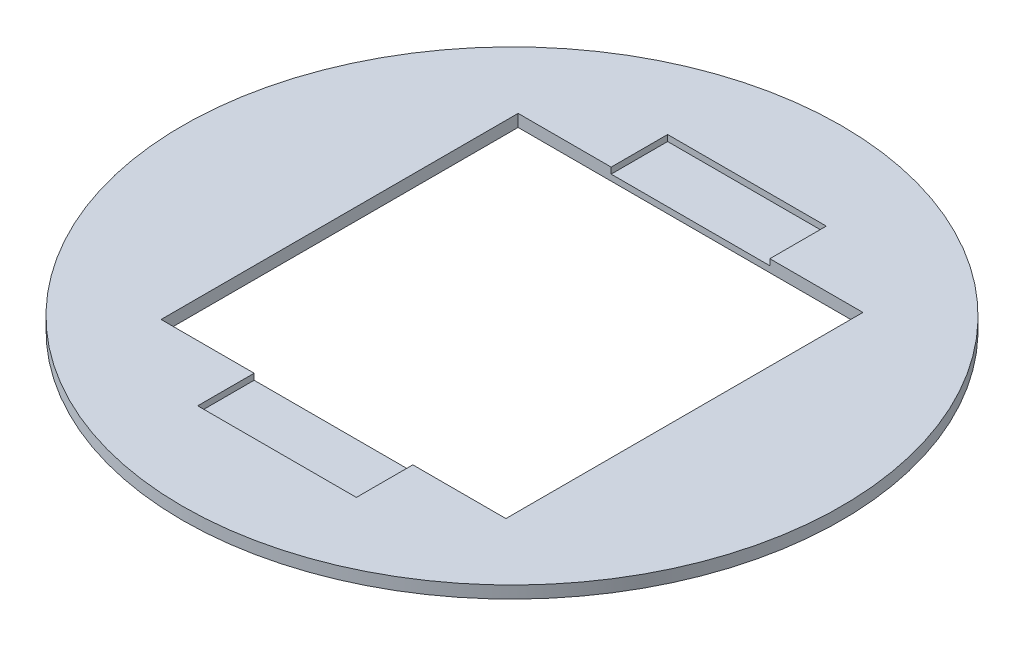
ISO-10303-21;
HEADER;
FILE_DESCRIPTION(('STEP AP214'),'2;1');
FILE_NAME('part.step','',(''),(''),'','','');
FILE_SCHEMA(('AUTOMOTIVE_DESIGN { 1 0 10303 214 1 1 1 1 }'));
ENDSEC;
DATA;
#1=APPLICATION_CONTEXT('core data for automotive mechanical design processes');
#2=APPLICATION_PROTOCOL_DEFINITION('international standard','automotive_design',2000,#1);
#3=PRODUCT_CONTEXT('',#1,'mechanical');
#4=PRODUCT('Part','Part','',(#3));
#5=PRODUCT_RELATED_PRODUCT_CATEGORY('part','',(#4));
#6=PRODUCT_DEFINITION_FORMATION('','',#4);
#7=PRODUCT_DEFINITION_CONTEXT('part definition',#1,'design');
#8=PRODUCT_DEFINITION('design','',#6,#7);
#9=PRODUCT_DEFINITION_SHAPE('','',#8);
#10=(LENGTH_UNIT() NAMED_UNIT(*) SI_UNIT(.MILLI.,.METRE.));
#11=(NAMED_UNIT(*) PLANE_ANGLE_UNIT() SI_UNIT($,.RADIAN.));
#12=(NAMED_UNIT(*) SI_UNIT($,.STERADIAN.) SOLID_ANGLE_UNIT());
#13=UNCERTAINTY_MEASURE_WITH_UNIT(LENGTH_MEASURE(1.E-05),#10,'distance_accuracy_value','');
#14=(GEOMETRIC_REPRESENTATION_CONTEXT(3) GLOBAL_UNCERTAINTY_ASSIGNED_CONTEXT((#13)) GLOBAL_UNIT_ASSIGNED_CONTEXT((#10,
#11,#12)) REPRESENTATION_CONTEXT('',''));
#15=CARTESIAN_POINT('',(0.,0.,0.));
#16=DIRECTION('',(0.,0.,1.));
#17=DIRECTION('',(1.,0.,0.));
#18=AXIS2_PLACEMENT_3D('',#15,#16,#17);
#19=CARTESIAN_POINT('',(0.,2.,0.));
#20=DIRECTION('',(0.,-1.,0.));
#21=DIRECTION('',(0.,0.,-1.));
#22=AXIS2_PLACEMENT_3D('',#19,#20,#21);
#23=CYLINDRICAL_SURFACE('',#22,54.);
#24=CARTESIAN_POINT('',(0.,2.,0.));
#25=DIRECTION('',(0.,1.,0.));
#26=DIRECTION('',(0.,0.,1.));
#27=AXIS2_PLACEMENT_3D('',#24,#25,#26);
#28=CIRCLE('',#27,54.);
#29=CARTESIAN_POINT('',(0.,2.,54.));
#30=VERTEX_POINT('',#29);
#31=EDGE_CURVE('E11',#30,#30,#28,.T.);
#32=ORIENTED_EDGE('',*,*,#31,.F.);
#33=EDGE_LOOP('',(#32));
#34=FACE_BOUND('',#33,.T.);
#35=CARTESIAN_POINT('',(0.,0.,0.));
#36=DIRECTION('',(0.,1.,0.));
#37=DIRECTION('',(0.,0.,1.));
#38=AXIS2_PLACEMENT_3D('',#35,#36,#37);
#39=CIRCLE('',#38,54.);
#40=CARTESIAN_POINT('',(0.,0.,54.));
#41=VERTEX_POINT('',#40);
#42=EDGE_CURVE('E36',#41,#41,#39,.T.);
#43=ORIENTED_EDGE('',*,*,#42,.T.);
#44=EDGE_LOOP('',(#43));
#45=FACE_BOUND('',#44,.T.);
#46=ADVANCED_FACE('F33',(#34,#45),#23,.T.);
#47=CARTESIAN_POINT('',(0.,2.,0.));
#48=DIRECTION('',(0.,1.,0.));
#49=DIRECTION('',(0.,0.,1.));
#50=AXIS2_PLACEMENT_3D('',#47,#48,#49);
#51=PLANE('',#50);
#52=DIRECTION('',(0.,0.,1.));
#53=VECTOR('',#52,1.);
#54=CARTESIAN_POINT('',(-13.,2.,38.5));
#55=LINE('',#54,#53);
#56=CARTESIAN_POINT('',(-13.,2.,29.25));
#57=VERTEX_POINT('',#56);
#58=CARTESIAN_POINT('',(-13.,2.,38.5));
#59=VERTEX_POINT('',#58);
#60=EDGE_CURVE('E142',#57,#59,#55,.T.);
#61=ORIENTED_EDGE('',*,*,#60,.F.);
#62=DIRECTION('',(1.,0.,0.));
#63=VECTOR('',#62,1.);
#64=CARTESIAN_POINT('',(28.25,2.,29.25));
#65=LINE('',#64,#63);
#66=CARTESIAN_POINT('',(-28.25,2.,29.25));
#67=VERTEX_POINT('',#66);
#68=EDGE_CURVE('E194',#67,#57,#65,.T.);
#69=ORIENTED_EDGE('',*,*,#68,.F.);
#70=DIRECTION('',(0.,0.,1.));
#71=VECTOR('',#70,1.);
#72=CARTESIAN_POINT('',(-28.25,2.,29.25));
#73=LINE('',#72,#71);
#74=CARTESIAN_POINT('',(-28.25,2.,-29.25));
#75=VERTEX_POINT('',#74);
#76=EDGE_CURVE('E176',#75,#67,#73,.T.);
#77=ORIENTED_EDGE('',*,*,#76,.F.);
#78=DIRECTION('',(-1.,0.,0.));
#79=VECTOR('',#78,1.);
#80=CARTESIAN_POINT('',(28.25,2.,-29.25));
#81=LINE('',#80,#79);
#82=CARTESIAN_POINT('',(-13.,2.,-29.25));
#83=VERTEX_POINT('',#82);
#84=EDGE_CURVE('E200',#83,#75,#81,.T.);
#85=ORIENTED_EDGE('',*,*,#84,.F.);
#86=DIRECTION('',(0.,0.,1.));
#87=VECTOR('',#86,1.);
#88=CARTESIAN_POINT('',(-13.,2.,-38.5));
#89=LINE('',#88,#87);
#90=CARTESIAN_POINT('',(-13.,2.,-38.5));
#91=VERTEX_POINT('',#90);
#92=EDGE_CURVE('E162',#91,#83,#89,.T.);
#93=ORIENTED_EDGE('',*,*,#92,.F.);
#94=DIRECTION('',(-1.,0.,0.));
#95=VECTOR('',#94,1.);
#96=CARTESIAN_POINT('',(-13.,2.,-38.5));
#97=LINE('',#96,#95);
#98=CARTESIAN_POINT('',(13.,2.,-38.5));
#99=VERTEX_POINT('',#98);
#100=EDGE_CURVE('E170',#99,#91,#97,.T.);
#101=ORIENTED_EDGE('',*,*,#100,.F.);
#102=DIRECTION('',(0.,0.,-1.));
#103=VECTOR('',#102,1.);
#104=CARTESIAN_POINT('',(13.,2.,-38.5));
#105=LINE('',#104,#103);
#106=CARTESIAN_POINT('',(13.,2.,-29.25));
#107=VERTEX_POINT('',#106);
#108=EDGE_CURVE('E154',#107,#99,#105,.T.);
#109=ORIENTED_EDGE('',*,*,#108,.F.);
#110=CARTESIAN_POINT('',(28.25,2.,-29.25));
#111=VERTEX_POINT('',#110);
#112=EDGE_CURVE('E201',#111,#107,#81,.T.);
#113=ORIENTED_EDGE('',*,*,#112,.F.);
#114=DIRECTION('',(0.,0.,-1.));
#115=VECTOR('',#114,1.);
#116=CARTESIAN_POINT('',(28.25,2.,29.25));
#117=LINE('',#116,#115);
#118=CARTESIAN_POINT('',(28.25,2.,29.25));
#119=VERTEX_POINT('',#118);
#120=EDGE_CURVE('E197',#119,#111,#117,.T.);
#121=ORIENTED_EDGE('',*,*,#120,.F.);
#122=CARTESIAN_POINT('',(13.,2.,29.25));
#123=VERTEX_POINT('',#122);
#124=EDGE_CURVE('E193',#123,#119,#65,.T.);
#125=ORIENTED_EDGE('',*,*,#124,.F.);
#126=DIRECTION('',(0.,0.,-1.));
#127=VECTOR('',#126,1.);
#128=CARTESIAN_POINT('',(13.,2.,38.5));
#129=LINE('',#128,#127);
#130=CARTESIAN_POINT('',(13.,2.,38.5));
#131=VERTEX_POINT('',#130);
#132=EDGE_CURVE('E145',#131,#123,#129,.T.);
#133=ORIENTED_EDGE('',*,*,#132,.F.);
#134=DIRECTION('',(1.,0.,0.));
#135=VECTOR('',#134,1.);
#136=CARTESIAN_POINT('',(-13.,2.,38.5));
#137=LINE('',#136,#135);
#138=EDGE_CURVE('E129',#59,#131,#137,.T.);
#139=ORIENTED_EDGE('',*,*,#138,.F.);
#140=EDGE_LOOP('',(#61,#69,#77,#85,#93,#101,#109,#113,#121,#125,#133,#139));
#141=FACE_BOUND('',#140,.T.);
#142=ORIENTED_EDGE('',*,*,#31,.T.);
#143=EDGE_LOOP('',(#142));
#144=FACE_BOUND('',#143,.T.);
#145=ADVANCED_FACE('F224',(#141,#144),#51,.T.);
#146=CARTESIAN_POINT('',(0.,0.,0.));
#147=DIRECTION('',(0.,1.,0.));
#148=DIRECTION('',(0.,0.,1.));
#149=AXIS2_PLACEMENT_3D('',#146,#147,#148);
#150=PLANE('',#149);
#151=DIRECTION('',(1.,0.,0.));
#152=VECTOR('',#151,1.);
#153=CARTESIAN_POINT('',(28.25,0.,-29.25));
#154=LINE('',#153,#152);
#155=CARTESIAN_POINT('',(-28.25,0.,-29.25));
#156=VERTEX_POINT('',#155);
#157=CARTESIAN_POINT('',(28.25,0.,-29.25));
#158=VERTEX_POINT('',#157);
#159=EDGE_CURVE('E186',#156,#158,#154,.T.);
#160=ORIENTED_EDGE('',*,*,#159,.F.);
#161=DIRECTION('',(0.,0.,-1.));
#162=VECTOR('',#161,1.);
#163=CARTESIAN_POINT('',(-28.25,0.,29.25));
#164=LINE('',#163,#162);
#165=CARTESIAN_POINT('',(-28.25,0.,29.25));
#166=VERTEX_POINT('',#165);
#167=EDGE_CURVE('E189',#166,#156,#164,.T.);
#168=ORIENTED_EDGE('',*,*,#167,.F.);
#169=DIRECTION('',(-1.,0.,0.));
#170=VECTOR('',#169,1.);
#171=CARTESIAN_POINT('',(28.25,0.,29.25));
#172=LINE('',#171,#170);
#173=CARTESIAN_POINT('',(28.25,0.,29.25));
#174=VERTEX_POINT('',#173);
#175=EDGE_CURVE('E191',#174,#166,#172,.T.);
#176=ORIENTED_EDGE('',*,*,#175,.F.);
#177=DIRECTION('',(0.,0.,1.));
#178=VECTOR('',#177,1.);
#179=CARTESIAN_POINT('',(28.25,0.,29.25));
#180=LINE('',#179,#178);
#181=EDGE_CURVE('E183',#158,#174,#180,.T.);
#182=ORIENTED_EDGE('',*,*,#181,.F.);
#183=EDGE_LOOP('',(#160,#168,#176,#182));
#184=FACE_BOUND('',#183,.T.);
#185=ORIENTED_EDGE('',*,*,#42,.F.);
#186=EDGE_LOOP('',(#185));
#187=FACE_BOUND('',#186,.T.);
#188=ADVANCED_FACE('F221',(#184,#187),#150,.F.);
#189=CARTESIAN_POINT('',(-28.25,-81.3295764159632,29.25));
#190=DIRECTION('',(-1.,0.,0.));
#191=DIRECTION('',(0.,0.,1.));
#192=AXIS2_PLACEMENT_3D('',#189,#190,#191);
#193=PLANE('',#192);
#194=ORIENTED_EDGE('',*,*,#167,.T.);
#195=DIRECTION('',(0.,1.,0.));
#196=VECTOR('',#195,1.);
#197=CARTESIAN_POINT('',(-28.25,-81.3295764159632,-29.25));
#198=LINE('',#197,#196);
#199=EDGE_CURVE('E187',#156,#75,#198,.T.);
#200=ORIENTED_EDGE('',*,*,#199,.T.);
#201=ORIENTED_EDGE('',*,*,#76,.T.);
#202=DIRECTION('',(0.,1.,0.));
#203=VECTOR('',#202,1.);
#204=CARTESIAN_POINT('',(-28.25,-81.3295764159632,29.25));
#205=LINE('',#204,#203);
#206=EDGE_CURVE('E204',#166,#67,#205,.T.);
#207=ORIENTED_EDGE('',*,*,#206,.F.);
#208=EDGE_LOOP('',(#194,#200,#201,#207));
#209=FACE_BOUND('',#208,.T.);
#210=ADVANCED_FACE('F223',(#209),#193,.F.);
#211=CARTESIAN_POINT('',(28.25,-81.3295764159632,-29.25));
#212=DIRECTION('',(0.,0.,-1.));
#213=DIRECTION('',(-1.,0.,0.));
#214=AXIS2_PLACEMENT_3D('',#211,#212,#213);
#215=PLANE('',#214);
#216=ORIENTED_EDGE('',*,*,#112,.T.);
#217=DIRECTION('',(0.,1.,0.));
#218=VECTOR('',#217,1.);
#219=CARTESIAN_POINT('',(13.,1.,-29.25));
#220=LINE('',#219,#218);
#221=CARTESIAN_POINT('',(13.,1.,-29.25));
#222=VERTEX_POINT('',#221);
#223=EDGE_CURVE('E174',#222,#107,#220,.T.);
#224=ORIENTED_EDGE('',*,*,#223,.F.);
#225=DIRECTION('',(1.,0.,0.));
#226=VECTOR('',#225,1.);
#227=CARTESIAN_POINT('',(-13.,1.,-29.25));
#228=LINE('',#227,#226);
#229=CARTESIAN_POINT('',(-13.,1.,-29.25));
#230=VERTEX_POINT('',#229);
#231=EDGE_CURVE('E165',#230,#222,#228,.T.);
#232=ORIENTED_EDGE('',*,*,#231,.F.);
#233=DIRECTION('',(0.,1.,0.));
#234=VECTOR('',#233,1.);
#235=CARTESIAN_POINT('',(-13.,1.,-29.25));
#236=LINE('',#235,#234);
#237=EDGE_CURVE('E177',#230,#83,#236,.T.);
#238=ORIENTED_EDGE('',*,*,#237,.T.);
#239=ORIENTED_EDGE('',*,*,#84,.T.);
#240=ORIENTED_EDGE('',*,*,#199,.F.);
#241=ORIENTED_EDGE('',*,*,#159,.T.);
#242=DIRECTION('',(0.,1.,0.));
#243=VECTOR('',#242,1.);
#244=CARTESIAN_POINT('',(28.25,-81.3295764159632,-29.25));
#245=LINE('',#244,#243);
#246=EDGE_CURVE('E207',#158,#111,#245,.T.);
#247=ORIENTED_EDGE('',*,*,#246,.T.);
#248=EDGE_LOOP('',(#216,#224,#232,#238,#239,#240,#241,#247));
#249=FACE_BOUND('',#248,.T.);
#250=ADVANCED_FACE('F230',(#249),#215,.F.);
#251=CARTESIAN_POINT('',(28.25,-81.3295764159632,29.25));
#252=DIRECTION('',(1.,0.,0.));
#253=DIRECTION('',(0.,0.,-1.));
#254=AXIS2_PLACEMENT_3D('',#251,#252,#253);
#255=PLANE('',#254);
#256=ORIENTED_EDGE('',*,*,#181,.T.);
#257=DIRECTION('',(0.,1.,0.));
#258=VECTOR('',#257,1.);
#259=CARTESIAN_POINT('',(28.25,-81.3295764159632,29.25));
#260=LINE('',#259,#258);
#261=EDGE_CURVE('E209',#174,#119,#260,.T.);
#262=ORIENTED_EDGE('',*,*,#261,.T.);
#263=ORIENTED_EDGE('',*,*,#120,.T.);
#264=ORIENTED_EDGE('',*,*,#246,.F.);
#265=EDGE_LOOP('',(#256,#262,#263,#264));
#266=FACE_BOUND('',#265,.T.);
#267=ADVANCED_FACE('F253',(#266),#255,.F.);
#268=CARTESIAN_POINT('',(28.25,-81.3295764159632,29.25));
#269=DIRECTION('',(0.,0.,1.));
#270=DIRECTION('',(1.,0.,0.));
#271=AXIS2_PLACEMENT_3D('',#268,#269,#270);
#272=PLANE('',#271);
#273=ORIENTED_EDGE('',*,*,#68,.T.);
#274=DIRECTION('',(0.,1.,0.));
#275=VECTOR('',#274,1.);
#276=CARTESIAN_POINT('',(-13.,1.,29.25));
#277=LINE('',#276,#275);
#278=CARTESIAN_POINT('',(-13.,1.,29.25));
#279=VERTEX_POINT('',#278);
#280=EDGE_CURVE('E155',#279,#57,#277,.T.);
#281=ORIENTED_EDGE('',*,*,#280,.F.);
#282=DIRECTION('',(-1.,0.,0.));
#283=VECTOR('',#282,1.);
#284=CARTESIAN_POINT('',(-13.,1.,29.25));
#285=LINE('',#284,#283);
#286=CARTESIAN_POINT('',(13.,1.,29.25));
#287=VERTEX_POINT('',#286);
#288=EDGE_CURVE('E138',#287,#279,#285,.T.);
#289=ORIENTED_EDGE('',*,*,#288,.F.);
#290=DIRECTION('',(0.,1.,0.));
#291=VECTOR('',#290,1.);
#292=CARTESIAN_POINT('',(13.,1.,29.25));
#293=LINE('',#292,#291);
#294=EDGE_CURVE('E132',#287,#123,#293,.T.);
#295=ORIENTED_EDGE('',*,*,#294,.T.);
#296=ORIENTED_EDGE('',*,*,#124,.T.);
#297=ORIENTED_EDGE('',*,*,#261,.F.);
#298=ORIENTED_EDGE('',*,*,#175,.T.);
#299=ORIENTED_EDGE('',*,*,#206,.T.);
#300=EDGE_LOOP('',(#273,#281,#289,#295,#296,#297,#298,#299));
#301=FACE_BOUND('',#300,.T.);
#302=ADVANCED_FACE('F268',(#301),#272,.F.);
#303=CARTESIAN_POINT('',(13.,1.,-38.5));
#304=DIRECTION('',(1.,0.,0.));
#305=DIRECTION('',(0.,0.,-1.));
#306=AXIS2_PLACEMENT_3D('',#303,#304,#305);
#307=PLANE('',#306);
#308=ORIENTED_EDGE('',*,*,#108,.T.);
#309=DIRECTION('',(0.,1.,0.));
#310=VECTOR('',#309,1.);
#311=CARTESIAN_POINT('',(13.,1.,-38.5));
#312=LINE('',#311,#310);
#313=CARTESIAN_POINT('',(13.,1.,-38.5));
#314=VERTEX_POINT('',#313);
#315=EDGE_CURVE('E167',#314,#99,#312,.T.);
#316=ORIENTED_EDGE('',*,*,#315,.F.);
#317=DIRECTION('',(0.,0.,-1.));
#318=VECTOR('',#317,1.);
#319=CARTESIAN_POINT('',(13.,1.,-38.5));
#320=LINE('',#319,#318);
#321=EDGE_CURVE('E158',#222,#314,#320,.T.);
#322=ORIENTED_EDGE('',*,*,#321,.F.);
#323=ORIENTED_EDGE('',*,*,#223,.T.);
#324=EDGE_LOOP('',(#308,#316,#322,#323));
#325=FACE_BOUND('',#324,.T.);
#326=ADVANCED_FACE('F273',(#325),#307,.F.);
#327=CARTESIAN_POINT('',(-13.,1.,-38.5));
#328=DIRECTION('',(-1.,0.,0.));
#329=DIRECTION('',(0.,0.,1.));
#330=AXIS2_PLACEMENT_3D('',#327,#328,#329);
#331=PLANE('',#330);
#332=ORIENTED_EDGE('',*,*,#92,.T.);
#333=ORIENTED_EDGE('',*,*,#237,.F.);
#334=DIRECTION('',(0.,0.,1.));
#335=VECTOR('',#334,1.);
#336=CARTESIAN_POINT('',(-13.,1.,-38.5));
#337=LINE('',#336,#335);
#338=CARTESIAN_POINT('',(-13.,1.,-38.5));
#339=VERTEX_POINT('',#338);
#340=EDGE_CURVE('E55',#339,#230,#337,.T.);
#341=ORIENTED_EDGE('',*,*,#340,.F.);
#342=DIRECTION('',(0.,1.,0.));
#343=VECTOR('',#342,1.);
#344=CARTESIAN_POINT('',(-13.,1.,-38.5));
#345=LINE('',#344,#343);
#346=EDGE_CURVE('E180',#339,#91,#345,.T.);
#347=ORIENTED_EDGE('',*,*,#346,.T.);
#348=EDGE_LOOP('',(#332,#333,#341,#347));
#349=FACE_BOUND('',#348,.T.);
#350=ADVANCED_FACE('F282',(#349),#331,.F.);
#351=CARTESIAN_POINT('',(-13.,1.,-38.5));
#352=DIRECTION('',(0.,0.,-1.));
#353=DIRECTION('',(-1.,0.,0.));
#354=AXIS2_PLACEMENT_3D('',#351,#352,#353);
#355=PLANE('',#354);
#356=ORIENTED_EDGE('',*,*,#100,.T.);
#357=ORIENTED_EDGE('',*,*,#346,.F.);
#358=DIRECTION('',(-1.,0.,0.));
#359=VECTOR('',#358,1.);
#360=CARTESIAN_POINT('',(-13.,1.,-38.5));
#361=LINE('',#360,#359);
#362=EDGE_CURVE('E161',#314,#339,#361,.T.);
#363=ORIENTED_EDGE('',*,*,#362,.F.);
#364=ORIENTED_EDGE('',*,*,#315,.T.);
#365=EDGE_LOOP('',(#356,#357,#363,#364));
#366=FACE_BOUND('',#365,.T.);
#367=ADVANCED_FACE('F292',(#366),#355,.F.);
#368=CARTESIAN_POINT('',(0.,1.,0.));
#369=DIRECTION('',(0.,1.,0.));
#370=DIRECTION('',(0.,0.,1.));
#371=AXIS2_PLACEMENT_3D('',#368,#369,#370);
#372=PLANE('',#371);
#373=ORIENTED_EDGE('',*,*,#321,.T.);
#374=ORIENTED_EDGE('',*,*,#362,.T.);
#375=ORIENTED_EDGE('',*,*,#340,.T.);
#376=ORIENTED_EDGE('',*,*,#231,.T.);
#377=EDGE_LOOP('',(#373,#374,#375,#376));
#378=FACE_BOUND('',#377,.T.);
#379=ADVANCED_FACE('F302',(#378),#372,.T.);
#380=CARTESIAN_POINT('',(-13.,1.,38.5));
#381=DIRECTION('',(0.,0.,1.));
#382=DIRECTION('',(1.,0.,0.));
#383=AXIS2_PLACEMENT_3D('',#380,#381,#382);
#384=PLANE('',#383);
#385=ORIENTED_EDGE('',*,*,#138,.T.);
#386=DIRECTION('',(0.,1.,0.));
#387=VECTOR('',#386,1.);
#388=CARTESIAN_POINT('',(13.,1.,38.5));
#389=LINE('',#388,#387);
#390=CARTESIAN_POINT('',(13.,1.,38.5));
#391=VERTEX_POINT('',#390);
#392=EDGE_CURVE('E124',#391,#131,#389,.T.);
#393=ORIENTED_EDGE('',*,*,#392,.F.);
#394=DIRECTION('',(1.,0.,0.));
#395=VECTOR('',#394,1.);
#396=CARTESIAN_POINT('',(-13.,1.,38.5));
#397=LINE('',#396,#395);
#398=CARTESIAN_POINT('',(-13.,1.,38.5));
#399=VERTEX_POINT('',#398);
#400=EDGE_CURVE('E126',#399,#391,#397,.T.);
#401=ORIENTED_EDGE('',*,*,#400,.F.);
#402=DIRECTION('',(0.,1.,0.));
#403=VECTOR('',#402,1.);
#404=CARTESIAN_POINT('',(-13.,1.,38.5));
#405=LINE('',#404,#403);
#406=EDGE_CURVE('E152',#399,#59,#405,.T.);
#407=ORIENTED_EDGE('',*,*,#406,.T.);
#408=EDGE_LOOP('',(#385,#393,#401,#407));
#409=FACE_BOUND('',#408,.T.);
#410=ADVANCED_FACE('F125',(#409),#384,.F.);
#411=CARTESIAN_POINT('',(-13.,1.,38.5));
#412=DIRECTION('',(-1.,0.,0.));
#413=DIRECTION('',(0.,0.,1.));
#414=AXIS2_PLACEMENT_3D('',#411,#412,#413);
#415=PLANE('',#414);
#416=ORIENTED_EDGE('',*,*,#60,.T.);
#417=ORIENTED_EDGE('',*,*,#406,.F.);
#418=DIRECTION('',(0.,0.,1.));
#419=VECTOR('',#418,1.);
#420=CARTESIAN_POINT('',(-13.,1.,38.5));
#421=LINE('',#420,#419);
#422=EDGE_CURVE('E133',#279,#399,#421,.T.);
#423=ORIENTED_EDGE('',*,*,#422,.F.);
#424=ORIENTED_EDGE('',*,*,#280,.T.);
#425=EDGE_LOOP('',(#416,#417,#423,#424));
#426=FACE_BOUND('',#425,.T.);
#427=ADVANCED_FACE('F320',(#426),#415,.F.);
#428=CARTESIAN_POINT('',(13.,1.,38.5));
#429=DIRECTION('',(1.,0.,0.));
#430=DIRECTION('',(0.,0.,-1.));
#431=AXIS2_PLACEMENT_3D('',#428,#429,#430);
#432=PLANE('',#431);
#433=ORIENTED_EDGE('',*,*,#132,.T.);
#434=ORIENTED_EDGE('',*,*,#294,.F.);
#435=DIRECTION('',(0.,0.,-1.));
#436=VECTOR('',#435,1.);
#437=CARTESIAN_POINT('',(13.,1.,38.5));
#438=LINE('',#437,#436);
#439=EDGE_CURVE('E47',#391,#287,#438,.T.);
#440=ORIENTED_EDGE('',*,*,#439,.F.);
#441=ORIENTED_EDGE('',*,*,#392,.T.);
#442=EDGE_LOOP('',(#433,#434,#440,#441));
#443=FACE_BOUND('',#442,.T.);
#444=ADVANCED_FACE('F135',(#443),#432,.F.);
#445=CARTESIAN_POINT('',(0.,1.,0.));
#446=DIRECTION('',(0.,1.,0.));
#447=DIRECTION('',(0.,0.,1.));
#448=AXIS2_PLACEMENT_3D('',#445,#446,#447);
#449=PLANE('',#448);
#450=ORIENTED_EDGE('',*,*,#400,.T.);
#451=ORIENTED_EDGE('',*,*,#439,.T.);
#452=ORIENTED_EDGE('',*,*,#288,.T.);
#453=ORIENTED_EDGE('',*,*,#422,.T.);
#454=EDGE_LOOP('',(#450,#451,#452,#453));
#455=FACE_BOUND('',#454,.T.);
#456=ADVANCED_FACE('F140',(#455),#449,.T.);
#457=CLOSED_SHELL('',(#46,#145,#188,#210,#250,#267,#302,#326,#350,#367,#379,#410,#427,#444,#456));
#458=MANIFOLD_SOLID_BREP('B2',#457);
#459=ADVANCED_BREP_SHAPE_REPRESENTATION('',(#18,#458),#14);
#460=SHAPE_DEFINITION_REPRESENTATION(#9,#459);
ENDSEC;
END-ISO-10303-21;
